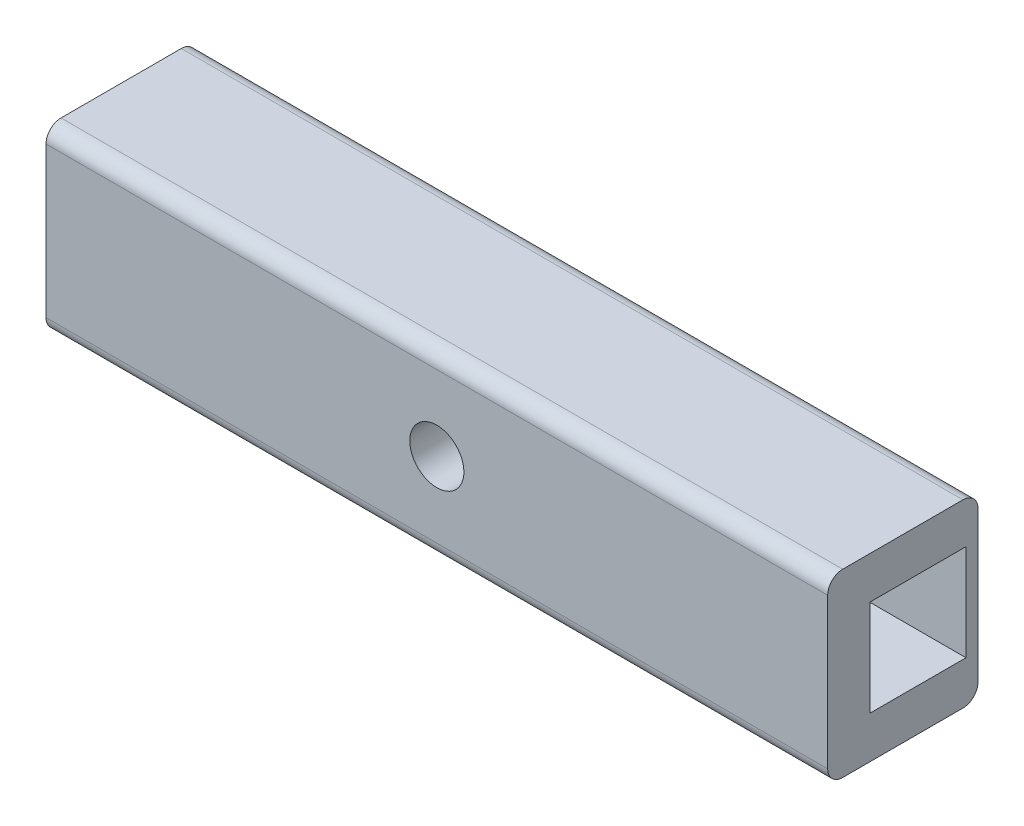
ISO-10303-21;
HEADER;
FILE_DESCRIPTION(('STEP AP214'),'2;1');
FILE_NAME('part.step','',(''),(''),'','','');
FILE_SCHEMA(('AUTOMOTIVE_DESIGN { 1 0 10303 214 1 1 1 1 }'));
ENDSEC;
DATA;
#1=APPLICATION_CONTEXT('core data for automotive mechanical design processes');
#2=APPLICATION_PROTOCOL_DEFINITION('international standard','automotive_design',2000,#1);
#3=PRODUCT_CONTEXT('',#1,'mechanical');
#4=PRODUCT('Part','Part','',(#3));
#5=PRODUCT_RELATED_PRODUCT_CATEGORY('part','',(#4));
#6=PRODUCT_DEFINITION_FORMATION('','',#4);
#7=PRODUCT_DEFINITION_CONTEXT('part definition',#1,'design');
#8=PRODUCT_DEFINITION('design','',#6,#7);
#9=PRODUCT_DEFINITION_SHAPE('','',#8);
#10=(LENGTH_UNIT() NAMED_UNIT(*) SI_UNIT(.MILLI.,.METRE.));
#11=(NAMED_UNIT(*) PLANE_ANGLE_UNIT() SI_UNIT($,.RADIAN.));
#12=(NAMED_UNIT(*) SI_UNIT($,.STERADIAN.) SOLID_ANGLE_UNIT());
#13=UNCERTAINTY_MEASURE_WITH_UNIT(LENGTH_MEASURE(1.E-05),#10,'distance_accuracy_value','');
#14=(GEOMETRIC_REPRESENTATION_CONTEXT(3) GLOBAL_UNCERTAINTY_ASSIGNED_CONTEXT((#13)) GLOBAL_UNIT_ASSIGNED_CONTEXT((#10,
#11,#12)) REPRESENTATION_CONTEXT('',''));
#15=CARTESIAN_POINT('',(0.,0.,0.));
#16=DIRECTION('',(0.,0.,1.));
#17=DIRECTION('',(1.,0.,0.));
#18=AXIS2_PLACEMENT_3D('',#15,#16,#17);
#19=CARTESIAN_POINT('',(13.,-1.7130394325271E-13,-3.));
#20=DIRECTION('',(-1.,0.,0.));
#21=DIRECTION('',(0.,1.,0.));
#22=AXIS2_PLACEMENT_3D('',#19,#20,#21);
#23=PLANE('',#22);
#24=DIRECTION('',(0.,0.,-1.));
#25=VECTOR('',#24,1.);
#26=CARTESIAN_POINT('',(13.,1.59999999999982,-1.59999999999999));
#27=LINE('',#26,#25);
#28=CARTESIAN_POINT('',(13.,1.59999999999995,1.6));
#29=VERTEX_POINT('',#28);
#30=CARTESIAN_POINT('',(13.,1.59999999999982,-1.59999999999999));
#31=VERTEX_POINT('',#30);
#32=EDGE_CURVE('E180',#29,#31,#27,.T.);
#33=ORIENTED_EDGE('',*,*,#32,.T.);
#34=DIRECTION('',(0.,-1.,0.));
#35=VECTOR('',#34,1.);
#36=CARTESIAN_POINT('',(13.,-1.60000000000018,-1.60000000000001));
#37=LINE('',#36,#35);
#38=CARTESIAN_POINT('',(13.,-1.60000000000018,-1.60000000000001));
#39=VERTEX_POINT('',#38);
#40=EDGE_CURVE('E186',#31,#39,#37,.T.);
#41=ORIENTED_EDGE('',*,*,#40,.T.);
#42=DIRECTION('',(0.,0.,1.));
#43=VECTOR('',#42,1.);
#44=CARTESIAN_POINT('',(13.,-1.60000000000018,-1.60000000000001));
#45=LINE('',#44,#43);
#46=CARTESIAN_POINT('',(13.,-1.60000000000019,1.59999999999999));
#47=VERTEX_POINT('',#46);
#48=EDGE_CURVE('E190',#39,#47,#45,.T.);
#49=ORIENTED_EDGE('',*,*,#48,.T.);
#50=DIRECTION('',(0.,1.,0.));
#51=VECTOR('',#50,1.);
#52=CARTESIAN_POINT('',(13.,-1.60000000000019,1.59999999999999));
#53=LINE('',#52,#51);
#54=EDGE_CURVE('E202',#47,#29,#53,.T.);
#55=ORIENTED_EDGE('',*,*,#54,.T.);
#56=EDGE_LOOP('',(#33,#41,#49,#55));
#57=FACE_BOUND('',#56,.T.);
#58=DIRECTION('',(0.,-1.,0.));
#59=VECTOR('',#58,1.);
#60=CARTESIAN_POINT('',(13.,-2.99999999999999,-2.00000000000001));
#61=LINE('',#60,#59);
#62=CARTESIAN_POINT('',(13.,2.50000000000001,-1.99999999999999));
#63=VERTEX_POINT('',#62);
#64=CARTESIAN_POINT('',(13.,-2.49999999999999,-2.00000000000001));
#65=VERTEX_POINT('',#64);
#66=EDGE_CURVE('E193',#63,#65,#61,.T.);
#67=ORIENTED_EDGE('',*,*,#66,.F.);
#68=CARTESIAN_POINT('',(13.,2.50000000000001,-1.49999999999999));
#69=DIRECTION('',(-1.,0.,0.));
#70=DIRECTION('',(0.,-1.,0.));
#71=AXIS2_PLACEMENT_3D('',#68,#69,#70);
#72=CIRCLE('',#71,0.5);
#73=CARTESIAN_POINT('',(13.,2.99999999999982,-1.49999999999999));
#74=VERTEX_POINT('',#73);
#75=EDGE_CURVE('E306',#63,#74,#72,.F.);
#76=ORIENTED_EDGE('',*,*,#75,.T.);
#77=DIRECTION('',(0.,0.,-1.));
#78=VECTOR('',#77,1.);
#79=CARTESIAN_POINT('',(13.,2.99999999999983,-2.99999999999999));
#80=LINE('',#79,#78);
#81=CARTESIAN_POINT('',(13.,2.99999999999981,2.50000000000001));
#82=VERTEX_POINT('',#81);
#83=EDGE_CURVE('E221',#82,#74,#80,.T.);
#84=ORIENTED_EDGE('',*,*,#83,.F.);
#85=CARTESIAN_POINT('',(13.,2.49999999999999,2.50000000000001));
#86=DIRECTION('',(-1.,0.,0.));
#87=DIRECTION('',(0.,-1.,0.));
#88=AXIS2_PLACEMENT_3D('',#85,#86,#87);
#89=CIRCLE('',#88,0.5);
#90=CARTESIAN_POINT('',(13.,2.49999999999999,3.00000000000001));
#91=VERTEX_POINT('',#90);
#92=EDGE_CURVE('E303',#82,#91,#89,.F.);
#93=ORIENTED_EDGE('',*,*,#92,.T.);
#94=DIRECTION('',(0.,1.,0.));
#95=VECTOR('',#94,1.);
#96=CARTESIAN_POINT('',(13.,2.99999999999981,3.00000000000001));
#97=LINE('',#96,#95);
#98=CARTESIAN_POINT('',(13.,-2.50000000000001,2.99999999999999));
#99=VERTEX_POINT('',#98);
#100=EDGE_CURVE('E225',#99,#91,#97,.T.);
#101=ORIENTED_EDGE('',*,*,#100,.F.);
#102=CARTESIAN_POINT('',(13.,-2.50000000000001,2.49999999999999));
#103=DIRECTION('',(-1.,0.,0.));
#104=DIRECTION('',(0.,-1.,0.));
#105=AXIS2_PLACEMENT_3D('',#102,#103,#104);
#106=CIRCLE('',#105,0.5);
#107=CARTESIAN_POINT('',(13.,-3.00000000000019,2.49999999999999));
#108=VERTEX_POINT('',#107);
#109=EDGE_CURVE('E297',#99,#108,#106,.F.);
#110=ORIENTED_EDGE('',*,*,#109,.T.);
#111=DIRECTION('',(0.,0.,1.));
#112=VECTOR('',#111,1.);
#113=CARTESIAN_POINT('',(13.,-3.00000000000017,-3.00000000000001));
#114=LINE('',#113,#112);
#115=CARTESIAN_POINT('',(13.,-3.00000000000018,-1.50000000000001));
#116=VERTEX_POINT('',#115);
#117=EDGE_CURVE('E212',#116,#108,#114,.T.);
#118=ORIENTED_EDGE('',*,*,#117,.F.);
#119=CARTESIAN_POINT('',(13.,-2.5,-1.50000000000001));
#120=DIRECTION('',(-1.,0.,0.));
#121=DIRECTION('',(0.,-1.,0.));
#122=AXIS2_PLACEMENT_3D('',#119,#120,#121);
#123=CIRCLE('',#122,0.5);
#124=EDGE_CURVE('E300',#116,#65,#123,.F.);
#125=ORIENTED_EDGE('',*,*,#124,.T.);
#126=EDGE_LOOP('',(#67,#76,#84,#93,#101,#110,#118,#125));
#127=FACE_BOUND('',#126,.T.);
#128=ADVANCED_FACE('F44',(#57,#127),#23,.F.);
#129=CARTESIAN_POINT('',(-13.,-2.99999999999999,-3.00000000000001));
#130=DIRECTION('',(0.,1.,0.));
#131=DIRECTION('',(-1.,0.,0.));
#132=AXIS2_PLACEMENT_3D('',#129,#130,#131);
#133=PLANE('',#132);
#134=DIRECTION('',(0.,0.,1.));
#135=VECTOR('',#134,1.);
#136=CARTESIAN_POINT('',(-13.,-2.99999999999999,-3.00000000000001));
#137=LINE('',#136,#135);
#138=CARTESIAN_POINT('',(-13.,-3.,-1.50000000000001));
#139=VERTEX_POINT('',#138);
#140=CARTESIAN_POINT('',(-13.,-3.00000000000001,2.49999999999999));
#141=VERTEX_POINT('',#140);
#142=EDGE_CURVE('E267',#139,#141,#137,.T.);
#143=ORIENTED_EDGE('',*,*,#142,.F.);
#144=DIRECTION('',(-1.,0.,0.));
#145=VECTOR('',#144,1.);
#146=CARTESIAN_POINT('',(13.,-3.,-1.50000000000001));
#147=LINE('',#146,#145);
#148=EDGE_CURVE('E11',#139,#116,#147,.F.);
#149=ORIENTED_EDGE('',*,*,#148,.T.);
#150=ORIENTED_EDGE('',*,*,#117,.T.);
#151=DIRECTION('',(1.,0.,0.));
#152=VECTOR('',#151,1.);
#153=CARTESIAN_POINT('',(-13.,-3.00000000000001,2.49999999999999));
#154=LINE('',#153,#152);
#155=EDGE_CURVE('E53',#108,#141,#154,.F.);
#156=ORIENTED_EDGE('',*,*,#155,.T.);
#157=EDGE_LOOP('',(#143,#149,#150,#156));
#158=FACE_BOUND('',#157,.T.);
#159=ADVANCED_FACE('F336',(#158),#133,.F.);
#160=CARTESIAN_POINT('',(-13.,3.00000000000001,-2.99999999999999));
#161=DIRECTION('',(0.,-1.,0.));
#162=DIRECTION('',(1.,0.,0.));
#163=AXIS2_PLACEMENT_3D('',#160,#161,#162);
#164=PLANE('',#163);
#165=ORIENTED_EDGE('',*,*,#83,.T.);
#166=DIRECTION('',(1.,0.,0.));
#167=VECTOR('',#166,1.);
#168=CARTESIAN_POINT('',(-13.,3.00000000000001,-1.49999999999999));
#169=LINE('',#168,#167);
#170=CARTESIAN_POINT('',(-13.,3.00000000000001,-1.49999999999999));
#171=VERTEX_POINT('',#170);
#172=EDGE_CURVE('E313',#74,#171,#169,.F.);
#173=ORIENTED_EDGE('',*,*,#172,.T.);
#174=DIRECTION('',(0.,0.,-1.));
#175=VECTOR('',#174,1.);
#176=CARTESIAN_POINT('',(-13.,3.00000000000001,-2.99999999999999));
#177=LINE('',#176,#175);
#178=CARTESIAN_POINT('',(-13.,2.99999999999999,2.50000000000001));
#179=VERTEX_POINT('',#178);
#180=EDGE_CURVE('E282',#179,#171,#177,.T.);
#181=ORIENTED_EDGE('',*,*,#180,.F.);
#182=DIRECTION('',(1.,0.,0.));
#183=VECTOR('',#182,1.);
#184=CARTESIAN_POINT('',(13.,2.99999999999999,2.50000000000001));
#185=LINE('',#184,#183);
#186=EDGE_CURVE('E309',#179,#82,#185,.T.);
#187=ORIENTED_EDGE('',*,*,#186,.T.);
#188=EDGE_LOOP('',(#165,#173,#181,#187));
#189=FACE_BOUND('',#188,.T.);
#190=ADVANCED_FACE('F354',(#189),#164,.F.);
#191=CARTESIAN_POINT('',(-13.,0.,-3.));
#192=DIRECTION('',(1.,0.,0.));
#193=DIRECTION('',(0.,1.,0.));
#194=AXIS2_PLACEMENT_3D('',#191,#192,#193);
#195=PLANE('',#194);
#196=DIRECTION('',(0.,-1.,0.));
#197=VECTOR('',#196,1.);
#198=CARTESIAN_POINT('',(-13.,-1.59999999999999,-1.60000000000001));
#199=LINE('',#198,#197);
#200=CARTESIAN_POINT('',(-13.,1.60000000000001,-1.59999999999999));
#201=VERTEX_POINT('',#200);
#202=CARTESIAN_POINT('',(-13.,-1.59999999999999,-1.60000000000001));
#203=VERTEX_POINT('',#202);
#204=EDGE_CURVE('E253',#201,#203,#199,.T.);
#205=ORIENTED_EDGE('',*,*,#204,.F.);
#206=DIRECTION('',(0.,0.,-1.));
#207=VECTOR('',#206,1.);
#208=CARTESIAN_POINT('',(-13.,1.60000000000001,-1.59999999999999));
#209=LINE('',#208,#207);
#210=CARTESIAN_POINT('',(-13.,1.59999999999999,1.6));
#211=VERTEX_POINT('',#210);
#212=EDGE_CURVE('E232',#211,#201,#209,.T.);
#213=ORIENTED_EDGE('',*,*,#212,.F.);
#214=DIRECTION('',(0.,1.,0.));
#215=VECTOR('',#214,1.);
#216=CARTESIAN_POINT('',(-13.,-1.60000000000001,1.59999999999999));
#217=LINE('',#216,#215);
#218=CARTESIAN_POINT('',(-13.,-1.60000000000001,1.59999999999999));
#219=VERTEX_POINT('',#218);
#220=EDGE_CURVE('E238',#219,#211,#217,.T.);
#221=ORIENTED_EDGE('',*,*,#220,.F.);
#222=DIRECTION('',(0.,0.,1.));
#223=VECTOR('',#222,1.);
#224=CARTESIAN_POINT('',(-13.,-1.59999999999999,-1.60000000000001));
#225=LINE('',#224,#223);
#226=EDGE_CURVE('E257',#203,#219,#225,.T.);
#227=ORIENTED_EDGE('',*,*,#226,.F.);
#228=EDGE_LOOP('',(#205,#213,#221,#227));
#229=FACE_BOUND('',#228,.T.);
#230=ORIENTED_EDGE('',*,*,#180,.T.);
#231=CARTESIAN_POINT('',(-13.,2.50000000000001,-1.49999999999999));
#232=DIRECTION('',(1.,0.,0.));
#233=DIRECTION('',(0.,1.,0.));
#234=AXIS2_PLACEMENT_3D('',#231,#232,#233);
#235=CIRCLE('',#234,0.5);
#236=CARTESIAN_POINT('',(-13.,2.50000000000001,-1.99999999999999));
#237=VERTEX_POINT('',#236);
#238=EDGE_CURVE('E324',#171,#237,#235,.F.);
#239=ORIENTED_EDGE('',*,*,#238,.T.);
#240=DIRECTION('',(0.,1.,0.));
#241=VECTOR('',#240,1.);
#242=CARTESIAN_POINT('',(-13.,-2.99999999999999,-2.00000000000001));
#243=LINE('',#242,#241);
#244=CARTESIAN_POINT('',(-13.,-2.49999999999999,-2.00000000000001));
#245=VERTEX_POINT('',#244);
#246=EDGE_CURVE('E366',#245,#237,#243,.T.);
#247=ORIENTED_EDGE('',*,*,#246,.F.);
#248=CARTESIAN_POINT('',(-13.,-2.5,-1.50000000000001));
#249=DIRECTION('',(1.,0.,0.));
#250=DIRECTION('',(0.,1.,0.));
#251=AXIS2_PLACEMENT_3D('',#248,#249,#250);
#252=CIRCLE('',#251,0.5);
#253=EDGE_CURVE('E318',#245,#139,#252,.F.);
#254=ORIENTED_EDGE('',*,*,#253,.T.);
#255=ORIENTED_EDGE('',*,*,#142,.T.);
#256=CARTESIAN_POINT('',(-13.,-2.50000000000001,2.49999999999999));
#257=DIRECTION('',(1.,0.,0.));
#258=DIRECTION('',(0.,1.,0.));
#259=AXIS2_PLACEMENT_3D('',#256,#257,#258);
#260=CIRCLE('',#259,0.5);
#261=CARTESIAN_POINT('',(-13.,-2.50000000000001,2.99999999999999));
#262=VERTEX_POINT('',#261);
#263=EDGE_CURVE('E67',#141,#262,#260,.F.);
#264=ORIENTED_EDGE('',*,*,#263,.T.);
#265=DIRECTION('',(0.,1.,0.));
#266=VECTOR('',#265,1.);
#267=CARTESIAN_POINT('',(-13.,2.99999999999999,3.00000000000001));
#268=LINE('',#267,#266);
#269=CARTESIAN_POINT('',(-13.,2.49999999999999,3.00000000000001));
#270=VERTEX_POINT('',#269);
#271=EDGE_CURVE('E279',#262,#270,#268,.T.);
#272=ORIENTED_EDGE('',*,*,#271,.T.);
#273=CARTESIAN_POINT('',(-13.,2.49999999999999,2.50000000000001));
#274=DIRECTION('',(1.,0.,0.));
#275=DIRECTION('',(0.,1.,0.));
#276=AXIS2_PLACEMENT_3D('',#273,#274,#275);
#277=CIRCLE('',#276,0.5);
#278=EDGE_CURVE('E321',#270,#179,#277,.F.);
#279=ORIENTED_EDGE('',*,*,#278,.T.);
#280=EDGE_LOOP('',(#230,#239,#247,#254,#255,#264,#272,#279));
#281=FACE_BOUND('',#280,.T.);
#282=ADVANCED_FACE('F340',(#229,#281),#195,.F.);
#283=CARTESIAN_POINT('',(0.,0.,-3.));
#284=DIRECTION('',(0.,0.,1.));
#285=DIRECTION('',(0.,-1.,0.));
#286=AXIS2_PLACEMENT_3D('',#283,#284,#285);
#287=CYLINDRICAL_SURFACE('',#286,0.9);
#288=CARTESIAN_POINT('',(0.,0.,3.));
#289=DIRECTION('',(0.,0.,1.));
#290=DIRECTION('',(0.,-1.,0.));
#291=AXIS2_PLACEMENT_3D('',#288,#289,#290);
#292=CIRCLE('',#291,0.9);
#293=CARTESIAN_POINT('',(0.,-0.90000000000001,3.));
#294=VERTEX_POINT('',#293);
#295=EDGE_CURVE('E228',#294,#294,#292,.T.);
#296=CARTESIAN_POINT('',(0.,0.,-2.));
#297=DIRECTION('',(0.,0.,-1.));
#298=DIRECTION('',(0.,1.,0.));
#299=AXIS2_PLACEMENT_3D('',#296,#297,#298);
#300=CIRCLE('',#299,0.9);
#301=CARTESIAN_POINT('',(0.,-0.899999999999993,-2.));
#302=VERTEX_POINT('',#301);
#303=EDGE_CURVE('E203',#302,#302,#300,.F.);
#304=CARTESIAN_POINT('',(0.,-0.90000000000001,3.));
#305=CARTESIAN_POINT('',(0.,-0.90000000000001,2.94791666666666));
#306=CARTESIAN_POINT('',(0.,-0.90000000000001,2.89583333333333));
#307=CARTESIAN_POINT('',(0.,-0.90000000000001,2.79166666666666));
#308=CARTESIAN_POINT('',(0.,-0.90000000000001,2.73958333333333));
#309=CARTESIAN_POINT('',(0.,-0.900000000000009,2.63541666666666));
#310=CARTESIAN_POINT('',(0.,-0.900000000000009,2.58333333333333));
#311=CARTESIAN_POINT('',(0.,-0.900000000000009,2.47916666666666));
#312=CARTESIAN_POINT('',(0.,-0.900000000000009,2.42708333333333));
#313=CARTESIAN_POINT('',(0.,-0.900000000000008,2.32291666666666));
#314=CARTESIAN_POINT('',(0.,-0.900000000000008,2.27083333333333));
#315=CARTESIAN_POINT('',(0.,-0.900000000000008,2.16666666666666));
#316=CARTESIAN_POINT('',(0.,-0.900000000000007,2.11458333333333));
#317=CARTESIAN_POINT('',(0.,-0.900000000000007,2.01041666666666));
#318=CARTESIAN_POINT('',(0.,-0.900000000000007,1.95833333333333));
#319=CARTESIAN_POINT('',(0.,-0.900000000000006,1.85416666666666));
#320=CARTESIAN_POINT('',(0.,-0.900000000000006,1.80208333333333));
#321=CARTESIAN_POINT('',(0.,-0.900000000000006,1.69791666666666));
#322=CARTESIAN_POINT('',(0.,-0.900000000000006,1.64583333333333));
#323=CARTESIAN_POINT('',(0.,-0.900000000000005,1.54166666666666));
#324=CARTESIAN_POINT('',(0.,-0.900000000000005,1.48958333333333));
#325=CARTESIAN_POINT('',(0.,-0.900000000000005,1.38541666666666));
#326=CARTESIAN_POINT('',(0.,-0.900000000000005,1.33333333333333));
#327=CARTESIAN_POINT('',(0.,-0.900000000000004,1.22916666666666));
#328=CARTESIAN_POINT('',(0.,-0.900000000000004,1.17708333333333));
#329=CARTESIAN_POINT('',(0.,-0.900000000000004,1.07291666666666));
#330=CARTESIAN_POINT('',(0.,-0.900000000000004,1.02083333333333));
#331=CARTESIAN_POINT('',(0.,-0.900000000000003,0.916666666666663));
#332=CARTESIAN_POINT('',(0.,-0.900000000000003,0.86458333333333));
#333=CARTESIAN_POINT('',(0.,-0.900000000000003,0.760416666666664));
#334=CARTESIAN_POINT('',(0.,-0.900000000000003,0.70833333333333));
#335=CARTESIAN_POINT('',(0.,-0.900000000000002,0.604166666666663));
#336=CARTESIAN_POINT('',(0.,-0.900000000000002,0.55208333333333));
#337=CARTESIAN_POINT('',(0.,-0.900000000000002,0.447916666666663));
#338=CARTESIAN_POINT('',(0.,-0.900000000000001,0.39583333333333));
#339=CARTESIAN_POINT('',(0.,-0.900000000000001,0.291666666666663));
#340=CARTESIAN_POINT('',(0.,-0.900000000000001,0.23958333333333));
#341=CARTESIAN_POINT('',(0.,-0.9,0.135416666666663));
#342=CARTESIAN_POINT('',(0.,-0.9,0.0833333333333298));
#343=CARTESIAN_POINT('',(0.,-0.9,-0.0208333333333368));
#344=CARTESIAN_POINT('',(0.,-0.9,-0.0729166666666702));
#345=CARTESIAN_POINT('',(0.,-0.899999999999999,-0.177083333333337));
#346=CARTESIAN_POINT('',(0.,-0.899999999999999,-0.22916666666667));
#347=CARTESIAN_POINT('',(0.,-0.899999999999999,-0.333333333333337));
#348=CARTESIAN_POINT('',(0.,-0.899999999999999,-0.38541666666667));
#349=CARTESIAN_POINT('',(0.,-0.899999999999998,-0.489583333333337));
#350=CARTESIAN_POINT('',(0.,-0.899999999999998,-0.54166666666667));
#351=CARTESIAN_POINT('',(0.,-0.899999999999998,-0.645833333333337));
#352=CARTESIAN_POINT('',(0.,-0.899999999999998,-0.69791666666667));
#353=CARTESIAN_POINT('',(0.,-0.899999999999997,-0.802083333333337));
#354=CARTESIAN_POINT('',(0.,-0.899999999999997,-0.854166666666671));
#355=CARTESIAN_POINT('',(0.,-0.899999999999997,-0.958333333333337));
#356=CARTESIAN_POINT('',(0.,-0.899999999999996,-1.01041666666667));
#357=CARTESIAN_POINT('',(0.,-0.899999999999996,-1.11458333333334));
#358=CARTESIAN_POINT('',(0.,-0.899999999999996,-1.16666666666667));
#359=CARTESIAN_POINT('',(0.,-0.899999999999996,-1.27083333333334));
#360=CARTESIAN_POINT('',(0.,-0.899999999999995,-1.32291666666667));
#361=CARTESIAN_POINT('',(0.,-0.899999999999995,-1.42708333333334));
#362=CARTESIAN_POINT('',(0.,-0.899999999999995,-1.47916666666667));
#363=CARTESIAN_POINT('',(0.,-0.899999999999994,-1.58333333333334));
#364=CARTESIAN_POINT('',(0.,-0.899999999999994,-1.63541666666667));
#365=CARTESIAN_POINT('',(0.,-0.899999999999994,-1.73958333333334));
#366=CARTESIAN_POINT('',(0.,-0.899999999999994,-1.79166666666667));
#367=CARTESIAN_POINT('',(0.,-0.899999999999993,-1.89583333333334));
#368=CARTESIAN_POINT('',(0.,-0.899999999999993,-1.94791666666667));
#369=CARTESIAN_POINT('',(0.,-0.899999999999993,-2.));
#370=B_SPLINE_CURVE_WITH_KNOTS('',3,(#304,#305,#306,#307,#308,#309,#310,#311,#312,#313,#314,
#315,#316,#317,#318,#319,#320,#321,#322,#323,#324,#325,#326,#327,#328,#329,#330,#331,#332,#333,
#334,#335,#336,#337,#338,#339,#340,#341,#342,#343,#344,#345,#346,#347,#348,#349,#350,#351,#352,
#353,#354,#355,#356,#357,#358,#359,#360,#361,#362,#363,#364,#365,#366,#367,#368,#369),
.UNSPECIFIED.,.F.,.F.,(4,2,2,2,2,2,2,2,2,2,2,2,2,2,2,2,2,2,2,2,2,2,2,2,2,2,2,2,2,2,2,2,4),(0.,
0.15625,0.3125,0.46875,0.625000000000001,0.78125,0.9375,1.09375,1.25,1.40625,1.5625,1.71875,
1.875,2.03125,2.1875,2.34375,2.5,2.65625,2.8125,2.96875,3.125,3.28125,3.4375,3.59375,3.75,
3.90625,4.0625,4.21875,4.375,4.53125,4.6875,4.84375,5.),.UNSPECIFIED.);
#371=EDGE_CURVE('BSEAM388',#294,#302,#370,.T.);
#372=ORIENTED_EDGE('',*,*,#295,.T.);
#373=ORIENTED_EDGE('',*,*,#303,.F.);
#374=ORIENTED_EDGE('',*,*,#371,.T.);
#375=ORIENTED_EDGE('',*,*,#371,.F.);
#376=EDGE_LOOP('',(#372,#374,#373,#375));
#377=FACE_BOUND('',#376,.T.);
#378=ADVANCED_FACE('F388',(#377),#287,.F.);
#379=CARTESIAN_POINT('',(0.,0.,3.));
#380=DIRECTION('',(0.,0.,1.));
#381=DIRECTION('',(0.,-1.,0.));
#382=AXIS2_PLACEMENT_3D('',#379,#380,#381);
#383=PLANE('',#382);
#384=ORIENTED_EDGE('',*,*,#295,.F.);
#385=EDGE_LOOP('',(#384));
#386=FACE_BOUND('',#385,.T.);
#387=ORIENTED_EDGE('',*,*,#100,.T.);
#388=DIRECTION('',(1.,0.,0.));
#389=VECTOR('',#388,1.);
#390=CARTESIAN_POINT('',(-13.,2.49999999999999,3.00000000000001));
#391=LINE('',#390,#389);
#392=EDGE_CURVE('E60',#91,#270,#391,.F.);
#393=ORIENTED_EDGE('',*,*,#392,.T.);
#394=ORIENTED_EDGE('',*,*,#271,.F.);
#395=DIRECTION('',(1.,0.,0.));
#396=VECTOR('',#395,1.);
#397=CARTESIAN_POINT('',(13.,-2.50000000000001,2.99999999999999));
#398=LINE('',#397,#396);
#399=EDGE_CURVE('E327',#262,#99,#398,.T.);
#400=ORIENTED_EDGE('',*,*,#399,.T.);
#401=EDGE_LOOP('',(#387,#393,#394,#400));
#402=FACE_BOUND('',#401,.T.);
#403=ADVANCED_FACE('F344',(#386,#402),#383,.T.);
#404=CARTESIAN_POINT('',(-3.,1.60000000000001,-1.59999999999999));
#405=DIRECTION('',(0.,1.,0.));
#406=DIRECTION('',(-1.,0.,0.));
#407=AXIS2_PLACEMENT_3D('',#404,#405,#406);
#408=PLANE('',#407);
#409=ORIENTED_EDGE('',*,*,#212,.T.);
#410=DIRECTION('',(-1.,0.,0.));
#411=VECTOR('',#410,1.);
#412=CARTESIAN_POINT('',(-3.,1.60000000000001,-1.59999999999999));
#413=LINE('',#412,#411);
#414=CARTESIAN_POINT('',(-3.,1.60000000000001,-1.59999999999999));
#415=VERTEX_POINT('',#414);
#416=EDGE_CURVE('E250',#415,#201,#413,.T.);
#417=ORIENTED_EDGE('',*,*,#416,.F.);
#418=DIRECTION('',(0.,0.,-1.));
#419=VECTOR('',#418,1.);
#420=CARTESIAN_POINT('',(-3.,1.60000000000001,-1.59999999999999));
#421=LINE('',#420,#419);
#422=CARTESIAN_POINT('',(-3.,1.59999999999999,1.6));
#423=VERTEX_POINT('',#422);
#424=EDGE_CURVE('E233',#423,#415,#421,.T.);
#425=ORIENTED_EDGE('',*,*,#424,.F.);
#426=DIRECTION('',(-1.,0.,0.));
#427=VECTOR('',#426,1.);
#428=CARTESIAN_POINT('',(-3.,1.59999999999999,1.6));
#429=LINE('',#428,#427);
#430=EDGE_CURVE('E264',#423,#211,#429,.T.);
#431=ORIENTED_EDGE('',*,*,#430,.T.);
#432=EDGE_LOOP('',(#409,#417,#425,#431));
#433=FACE_BOUND('',#432,.T.);
#434=ADVANCED_FACE('F401',(#433),#408,.F.);
#435=CARTESIAN_POINT('',(-3.,-1.60000000000001,1.59999999999999));
#436=DIRECTION('',(0.,0.,1.));
#437=DIRECTION('',(0.,-1.,0.));
#438=AXIS2_PLACEMENT_3D('',#435,#436,#437);
#439=PLANE('',#438);
#440=ORIENTED_EDGE('',*,*,#220,.T.);
#441=ORIENTED_EDGE('',*,*,#430,.F.);
#442=DIRECTION('',(0.,1.,0.));
#443=VECTOR('',#442,1.);
#444=CARTESIAN_POINT('',(-3.,-1.60000000000001,1.59999999999999));
#445=LINE('',#444,#443);
#446=CARTESIAN_POINT('',(-3.,-1.60000000000001,1.59999999999999));
#447=VERTEX_POINT('',#446);
#448=EDGE_CURVE('E246',#447,#423,#445,.T.);
#449=ORIENTED_EDGE('',*,*,#448,.F.);
#450=DIRECTION('',(-1.,0.,0.));
#451=VECTOR('',#450,1.);
#452=CARTESIAN_POINT('',(-3.,-1.60000000000001,1.59999999999999));
#453=LINE('',#452,#451);
#454=EDGE_CURVE('E268',#447,#219,#453,.T.);
#455=ORIENTED_EDGE('',*,*,#454,.T.);
#456=EDGE_LOOP('',(#440,#441,#449,#455));
#457=FACE_BOUND('',#456,.T.);
#458=ADVANCED_FACE('F397',(#457),#439,.F.);
#459=CARTESIAN_POINT('',(-3.,-1.59999999999999,-1.60000000000001));
#460=DIRECTION('',(0.,-1.,0.));
#461=DIRECTION('',(1.,0.,0.));
#462=AXIS2_PLACEMENT_3D('',#459,#460,#461);
#463=PLANE('',#462);
#464=ORIENTED_EDGE('',*,*,#226,.T.);
#465=ORIENTED_EDGE('',*,*,#454,.F.);
#466=DIRECTION('',(0.,0.,1.));
#467=VECTOR('',#466,1.);
#468=CARTESIAN_POINT('',(-3.,-1.59999999999999,-1.60000000000001));
#469=LINE('',#468,#467);
#470=CARTESIAN_POINT('',(-3.,-1.59999999999999,-1.60000000000001));
#471=VERTEX_POINT('',#470);
#472=EDGE_CURVE('E242',#471,#447,#469,.T.);
#473=ORIENTED_EDGE('',*,*,#472,.F.);
#474=DIRECTION('',(-1.,0.,0.));
#475=VECTOR('',#474,1.);
#476=CARTESIAN_POINT('',(-3.,-1.59999999999999,-1.60000000000001));
#477=LINE('',#476,#475);
#478=EDGE_CURVE('E271',#471,#203,#477,.T.);
#479=ORIENTED_EDGE('',*,*,#478,.T.);
#480=EDGE_LOOP('',(#464,#465,#473,#479));
#481=FACE_BOUND('',#480,.T.);
#482=ADVANCED_FACE('F400',(#481),#463,.F.);
#483=CARTESIAN_POINT('',(-3.,-1.59999999999999,-1.60000000000001));
#484=DIRECTION('',(0.,0.,-1.));
#485=DIRECTION('',(0.,1.,0.));
#486=AXIS2_PLACEMENT_3D('',#483,#484,#485);
#487=PLANE('',#486);
#488=ORIENTED_EDGE('',*,*,#204,.T.);
#489=ORIENTED_EDGE('',*,*,#478,.F.);
#490=DIRECTION('',(0.,-1.,0.));
#491=VECTOR('',#490,1.);
#492=CARTESIAN_POINT('',(-3.,-1.59999999999999,-1.60000000000001));
#493=LINE('',#492,#491);
#494=EDGE_CURVE('E237',#415,#471,#493,.T.);
#495=ORIENTED_EDGE('',*,*,#494,.F.);
#496=ORIENTED_EDGE('',*,*,#416,.T.);
#497=EDGE_LOOP('',(#488,#489,#495,#496));
#498=FACE_BOUND('',#497,.T.);
#499=ADVANCED_FACE('F395',(#498),#487,.F.);
#500=CARTESIAN_POINT('',(-3.,0.,-3.));
#501=DIRECTION('',(-1.,0.,0.));
#502=DIRECTION('',(0.,-1.,0.));
#503=AXIS2_PLACEMENT_3D('',#500,#501,#502);
#504=PLANE('',#503);
#505=ORIENTED_EDGE('',*,*,#424,.T.);
#506=ORIENTED_EDGE('',*,*,#494,.T.);
#507=ORIENTED_EDGE('',*,*,#472,.T.);
#508=ORIENTED_EDGE('',*,*,#448,.T.);
#509=EDGE_LOOP('',(#505,#506,#507,#508));
#510=FACE_BOUND('',#509,.T.);
#511=ADVANCED_FACE('F392',(#510),#504,.T.);
#512=CARTESIAN_POINT('',(3.00000000000002,1.59999999999996,-1.59999999999999));
#513=DIRECTION('',(0.,-1.,0.));
#514=DIRECTION('',(1.,0.,0.));
#515=AXIS2_PLACEMENT_3D('',#512,#513,#514);
#516=PLANE('',#515);
#517=ORIENTED_EDGE('',*,*,#32,.F.);
#518=DIRECTION('',(1.,0.,0.));
#519=VECTOR('',#518,1.);
#520=CARTESIAN_POINT('',(3.00000000000002,1.59999999999995,1.6));
#521=LINE('',#520,#519);
#522=CARTESIAN_POINT('',(3.00000000000002,1.59999999999995,1.6));
#523=VERTEX_POINT('',#522);
#524=EDGE_CURVE('E164',#523,#29,#521,.T.);
#525=ORIENTED_EDGE('',*,*,#524,.F.);
#526=DIRECTION('',(0.,0.,-1.));
#527=VECTOR('',#526,1.);
#528=CARTESIAN_POINT('',(3.00000000000002,1.59999999999996,-1.59999999999999));
#529=LINE('',#528,#527);
#530=CARTESIAN_POINT('',(3.00000000000002,1.59999999999996,-1.59999999999999));
#531=VERTEX_POINT('',#530);
#532=EDGE_CURVE('E172',#523,#531,#529,.T.);
#533=ORIENTED_EDGE('',*,*,#532,.T.);
#534=DIRECTION('',(1.,0.,0.));
#535=VECTOR('',#534,1.);
#536=CARTESIAN_POINT('',(3.00000000000002,1.59999999999996,-1.59999999999999));
#537=LINE('',#536,#535);
#538=EDGE_CURVE('E209',#531,#31,#537,.T.);
#539=ORIENTED_EDGE('',*,*,#538,.T.);
#540=EDGE_LOOP('',(#517,#525,#533,#539));
#541=FACE_BOUND('',#540,.T.);
#542=ADVANCED_FACE('F176',(#541),#516,.T.);
#543=CARTESIAN_POINT('',(2.99999999999998,-1.60000000000004,-1.60000000000001));
#544=DIRECTION('',(0.,0.,1.));
#545=DIRECTION('',(0.,-1.,0.));
#546=AXIS2_PLACEMENT_3D('',#543,#544,#545);
#547=PLANE('',#546);
#548=ORIENTED_EDGE('',*,*,#40,.F.);
#549=ORIENTED_EDGE('',*,*,#538,.F.);
#550=DIRECTION('',(0.,-1.,0.));
#551=VECTOR('',#550,1.);
#552=CARTESIAN_POINT('',(2.99999999999998,-1.60000000000004,-1.60000000000001));
#553=LINE('',#552,#551);
#554=CARTESIAN_POINT('',(2.99999999999998,-1.60000000000004,-1.60000000000001));
#555=VERTEX_POINT('',#554);
#556=EDGE_CURVE('E182',#531,#555,#553,.T.);
#557=ORIENTED_EDGE('',*,*,#556,.T.);
#558=DIRECTION('',(1.,0.,0.));
#559=VECTOR('',#558,1.);
#560=CARTESIAN_POINT('',(2.99999999999998,-1.60000000000004,-1.60000000000001));
#561=LINE('',#560,#559);
#562=EDGE_CURVE('E213',#555,#39,#561,.T.);
#563=ORIENTED_EDGE('',*,*,#562,.T.);
#564=EDGE_LOOP('',(#548,#549,#557,#563));
#565=FACE_BOUND('',#564,.T.);
#566=ADVANCED_FACE('F430',(#565),#547,.T.);
#567=CARTESIAN_POINT('',(2.99999999999998,-1.60000000000004,-1.60000000000001));
#568=DIRECTION('',(0.,1.,0.));
#569=DIRECTION('',(-1.,0.,0.));
#570=AXIS2_PLACEMENT_3D('',#567,#568,#569);
#571=PLANE('',#570);
#572=ORIENTED_EDGE('',*,*,#48,.F.);
#573=ORIENTED_EDGE('',*,*,#562,.F.);
#574=DIRECTION('',(0.,0.,1.));
#575=VECTOR('',#574,1.);
#576=CARTESIAN_POINT('',(2.99999999999998,-1.60000000000004,-1.60000000000001));
#577=LINE('',#576,#575);
#578=CARTESIAN_POINT('',(2.99999999999998,-1.60000000000005,1.59999999999999));
#579=VERTEX_POINT('',#578);
#580=EDGE_CURVE('E171',#555,#579,#577,.T.);
#581=ORIENTED_EDGE('',*,*,#580,.T.);
#582=DIRECTION('',(1.,0.,0.));
#583=VECTOR('',#582,1.);
#584=CARTESIAN_POINT('',(2.99999999999998,-1.60000000000005,1.59999999999999));
#585=LINE('',#584,#583);
#586=EDGE_CURVE('E166',#579,#47,#585,.T.);
#587=ORIENTED_EDGE('',*,*,#586,.T.);
#588=EDGE_LOOP('',(#572,#573,#581,#587));
#589=FACE_BOUND('',#588,.T.);
#590=ADVANCED_FACE('F433',(#589),#571,.T.);
#591=CARTESIAN_POINT('',(2.99999999999998,-1.60000000000005,1.59999999999999));
#592=DIRECTION('',(0.,0.,-1.));
#593=DIRECTION('',(0.,1.,0.));
#594=AXIS2_PLACEMENT_3D('',#591,#592,#593);
#595=PLANE('',#594);
#596=ORIENTED_EDGE('',*,*,#54,.F.);
#597=ORIENTED_EDGE('',*,*,#586,.F.);
#598=DIRECTION('',(0.,1.,0.));
#599=VECTOR('',#598,1.);
#600=CARTESIAN_POINT('',(2.99999999999998,-1.60000000000005,1.59999999999999));
#601=LINE('',#600,#599);
#602=EDGE_CURVE('E160',#579,#523,#601,.T.);
#603=ORIENTED_EDGE('',*,*,#602,.T.);
#604=ORIENTED_EDGE('',*,*,#524,.T.);
#605=EDGE_LOOP('',(#596,#597,#603,#604));
#606=FACE_BOUND('',#605,.T.);
#607=ADVANCED_FACE('F163',(#606),#595,.T.);
#608=CARTESIAN_POINT('',(3.,0.,-3.));
#609=DIRECTION('',(1.,0.,0.));
#610=DIRECTION('',(0.,-1.,0.));
#611=AXIS2_PLACEMENT_3D('',#608,#609,#610);
#612=PLANE('',#611);
#613=ORIENTED_EDGE('',*,*,#532,.F.);
#614=ORIENTED_EDGE('',*,*,#602,.F.);
#615=ORIENTED_EDGE('',*,*,#580,.F.);
#616=ORIENTED_EDGE('',*,*,#556,.F.);
#617=EDGE_LOOP('',(#613,#614,#615,#616));
#618=FACE_BOUND('',#617,.T.);
#619=ADVANCED_FACE('F184',(#618),#612,.T.);
#620=CARTESIAN_POINT('',(0.,0.,-2.));
#621=DIRECTION('',(0.,0.,-1.));
#622=DIRECTION('',(0.,1.,0.));
#623=AXIS2_PLACEMENT_3D('',#620,#621,#622);
#624=PLANE('',#623);
#625=ORIENTED_EDGE('',*,*,#246,.T.);
#626=DIRECTION('',(1.,0.,0.));
#627=VECTOR('',#626,1.);
#628=CARTESIAN_POINT('',(13.,2.50000000000001,-1.99999999999999));
#629=LINE('',#628,#627);
#630=EDGE_CURVE('E293',#237,#63,#629,.T.);
#631=ORIENTED_EDGE('',*,*,#630,.T.);
#632=ORIENTED_EDGE('',*,*,#66,.T.);
#633=DIRECTION('',(-1.,0.,0.));
#634=VECTOR('',#633,1.);
#635=CARTESIAN_POINT('',(-13.,-2.49999999999999,-2.00000000000001));
#636=LINE('',#635,#634);
#637=EDGE_CURVE('E286',#65,#245,#636,.T.);
#638=ORIENTED_EDGE('',*,*,#637,.T.);
#639=EDGE_LOOP('',(#625,#631,#632,#638));
#640=FACE_BOUND('',#639,.T.);
#641=ORIENTED_EDGE('',*,*,#303,.T.);
#642=EDGE_LOOP('',(#641));
#643=FACE_BOUND('',#642,.T.);
#644=ADVANCED_FACE('F363',(#640,#643),#624,.T.);
#645=CARTESIAN_POINT('',(0.,2.50000000000001,-1.49999999999999));
#646=DIRECTION('',(-1.,0.,0.));
#647=DIRECTION('',(0.,-1.,0.));
#648=AXIS2_PLACEMENT_3D('',#645,#646,#647);
#649=CYLINDRICAL_SURFACE('',#648,0.5);
#650=ORIENTED_EDGE('',*,*,#238,.F.);
#651=ORIENTED_EDGE('',*,*,#172,.F.);
#652=ORIENTED_EDGE('',*,*,#75,.F.);
#653=ORIENTED_EDGE('',*,*,#630,.F.);
#654=EDGE_LOOP('',(#650,#651,#652,#653));
#655=FACE_BOUND('',#654,.T.);
#656=ADVANCED_FACE('F360',(#655),#649,.T.);
#657=CARTESIAN_POINT('',(-13.,2.49999999999999,2.50000000000001));
#658=DIRECTION('',(-1.,0.,0.));
#659=DIRECTION('',(0.,-1.,0.));
#660=AXIS2_PLACEMENT_3D('',#657,#658,#659);
#661=CYLINDRICAL_SURFACE('',#660,0.5);
#662=ORIENTED_EDGE('',*,*,#278,.F.);
#663=ORIENTED_EDGE('',*,*,#392,.F.);
#664=ORIENTED_EDGE('',*,*,#92,.F.);
#665=ORIENTED_EDGE('',*,*,#186,.F.);
#666=EDGE_LOOP('',(#662,#663,#664,#665));
#667=FACE_BOUND('',#666,.T.);
#668=ADVANCED_FACE('F351',(#667),#661,.T.);
#669=CARTESIAN_POINT('',(0.,-2.5,-1.50000000000001));
#670=DIRECTION('',(1.,0.,0.));
#671=DIRECTION('',(0.,1.,0.));
#672=AXIS2_PLACEMENT_3D('',#669,#670,#671);
#673=CYLINDRICAL_SURFACE('',#672,0.5);
#674=ORIENTED_EDGE('',*,*,#124,.F.);
#675=ORIENTED_EDGE('',*,*,#148,.F.);
#676=ORIENTED_EDGE('',*,*,#253,.F.);
#677=ORIENTED_EDGE('',*,*,#637,.F.);
#678=EDGE_LOOP('',(#674,#675,#676,#677));
#679=FACE_BOUND('',#678,.T.);
#680=ADVANCED_FACE('F371',(#679),#673,.T.);
#681=CARTESIAN_POINT('',(0.,-2.50000000000001,2.49999999999999));
#682=DIRECTION('',(-1.,0.,0.));
#683=DIRECTION('',(0.,-1.,0.));
#684=AXIS2_PLACEMENT_3D('',#681,#682,#683);
#685=CYLINDRICAL_SURFACE('',#684,0.5);
#686=ORIENTED_EDGE('',*,*,#263,.F.);
#687=ORIENTED_EDGE('',*,*,#155,.F.);
#688=ORIENTED_EDGE('',*,*,#109,.F.);
#689=ORIENTED_EDGE('',*,*,#399,.F.);
#690=EDGE_LOOP('',(#686,#687,#688,#689));
#691=FACE_BOUND('',#690,.T.);
#692=ADVANCED_FACE('F46',(#691),#685,.T.);
#693=CLOSED_SHELL('',(#128,#159,#190,#282,#378,#403,#434,#458,#482,#499,#511,#542,#566,#590,
#607,#619,#644,#656,#668,#680,#692));
#694=MANIFOLD_SOLID_BREP('B2',#693);
#695=ADVANCED_BREP_SHAPE_REPRESENTATION('',(#18,#694),#14);
#696=SHAPE_DEFINITION_REPRESENTATION(#9,#695);
ENDSEC;
END-ISO-10303-21;
